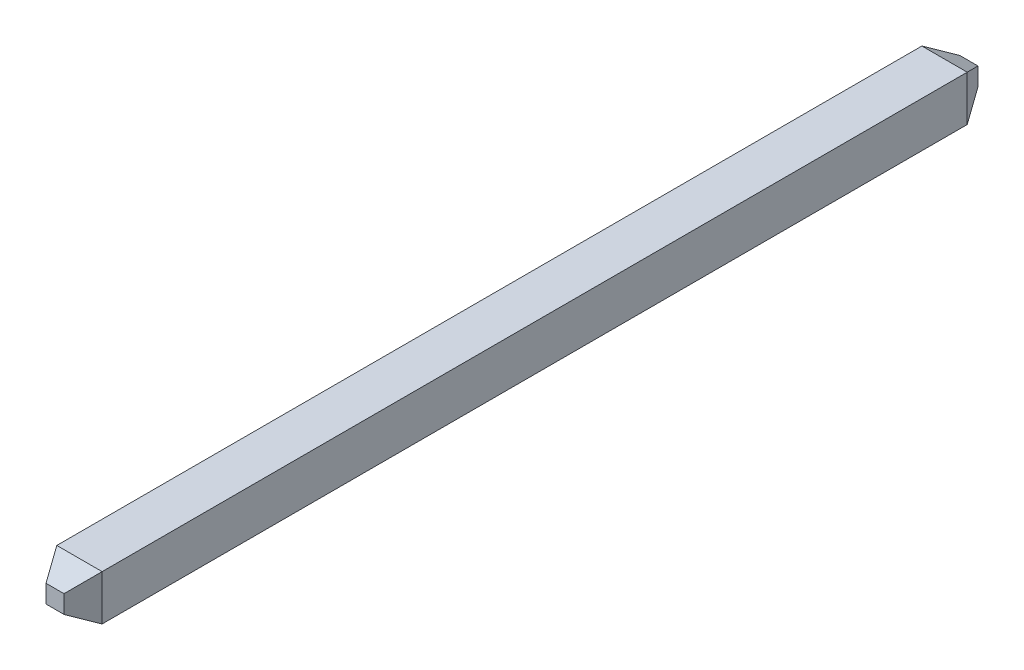
ISO-10303-21;
HEADER;
FILE_DESCRIPTION(('STEP AP214'),'2;1');
FILE_NAME('part.step','',(''),(''),'','','');
FILE_SCHEMA(('AUTOMOTIVE_DESIGN { 1 0 10303 214 1 1 1 1 }'));
ENDSEC;
DATA;
#1=APPLICATION_CONTEXT('core data for automotive mechanical design processes');
#2=APPLICATION_PROTOCOL_DEFINITION('international standard','automotive_design',2000,#1);
#3=PRODUCT_CONTEXT('',#1,'mechanical');
#4=PRODUCT('Part','Part','',(#3));
#5=PRODUCT_RELATED_PRODUCT_CATEGORY('part','',(#4));
#6=PRODUCT_DEFINITION_FORMATION('','',#4);
#7=PRODUCT_DEFINITION_CONTEXT('part definition',#1,'design');
#8=PRODUCT_DEFINITION('design','',#6,#7);
#9=PRODUCT_DEFINITION_SHAPE('','',#8);
#10=(LENGTH_UNIT() NAMED_UNIT(*) SI_UNIT(.MILLI.,.METRE.));
#11=(NAMED_UNIT(*) PLANE_ANGLE_UNIT() SI_UNIT($,.RADIAN.));
#12=(NAMED_UNIT(*) SI_UNIT($,.STERADIAN.) SOLID_ANGLE_UNIT());
#13=UNCERTAINTY_MEASURE_WITH_UNIT(LENGTH_MEASURE(1.E-05),#10,'distance_accuracy_value','');
#14=(GEOMETRIC_REPRESENTATION_CONTEXT(3) GLOBAL_UNCERTAINTY_ASSIGNED_CONTEXT((#13)) GLOBAL_UNIT_ASSIGNED_CONTEXT((#10,
#11,#12)) REPRESENTATION_CONTEXT('',''));
#15=CARTESIAN_POINT('',(0.,0.,0.));
#16=DIRECTION('',(0.,0.,1.));
#17=DIRECTION('',(1.,0.,0.));
#18=AXIS2_PLACEMENT_3D('',#15,#16,#17);
#19=CARTESIAN_POINT('',(7.74011510041924,-1.595,-3.20872569516347));
#20=DIRECTION('',(0.872569516347452,0.,-0.488489958076083));
#21=DIRECTION('',(-0.488489958076083,0.,-0.872569516347452));
#22=AXIS2_PLACEMENT_3D('',#19,#20,#21);
#23=PLANE('',#22);
#24=DIRECTION('',(0.,1.,0.));
#25=VECTOR('',#24,1.);
#26=CARTESIAN_POINT('',(7.93534185664469,-1.595,-2.86000017186176));
#27=LINE('',#26,#25);
#28=CARTESIAN_POINT('',(7.93534185663263,-1.58500002468493,-2.85999984563027));
#29=VERTEX_POINT('',#28);
#30=CARTESIAN_POINT('',(7.93534201729187,-0.954999839641339,-2.8599998849043));
#31=VERTEX_POINT('',#30);
#32=EDGE_CURVE('E118',#29,#31,#27,.T.);
#33=ORIENTED_EDGE('',*,*,#32,.F.);
#34=DIRECTION('',(0.43907261756865,-0.438284036988111,0.784297353956278));
#35=VECTOR('',#34,1.);
#36=CARTESIAN_POINT('',(7.745,-1.395,-3.2));
#37=LINE('',#36,#35);
#38=CARTESIAN_POINT('',(7.745,-1.395,-3.2));
#39=VERTEX_POINT('',#38);
#40=EDGE_CURVE('E116',#39,#29,#37,.T.);
#41=ORIENTED_EDGE('',*,*,#40,.F.);
#42=DIRECTION('',(0.,1.,0.));
#43=VECTOR('',#42,1.);
#44=CARTESIAN_POINT('',(7.745,-1.405,-3.2));
#45=LINE('',#44,#43);
#46=CARTESIAN_POINT('',(7.745,-1.145,-3.2));
#47=VERTEX_POINT('',#46);
#48=EDGE_CURVE('E79',#47,#39,#45,.F.);
#49=ORIENTED_EDGE('',*,*,#48,.F.);
#50=DIRECTION('',(-0.439072617568649,-0.43828403698811,-0.784297353956278));
#51=VECTOR('',#50,1.);
#52=CARTESIAN_POINT('',(7.93534185664468,-0.955000000000001,-2.86000017186176));
#53=LINE('',#52,#51);
#54=EDGE_CURVE('E110',#31,#47,#53,.T.);
#55=ORIENTED_EDGE('',*,*,#54,.F.);
#56=EDGE_LOOP('',(#33,#41,#49,#55));
#57=FACE_BOUND('',#56,.T.);
#58=ADVANCED_FACE('F17',(#57),#23,.T.);
#59=CARTESIAN_POINT('',(7.74036702814295,-1.595,9.50441734607014));
#60=DIRECTION('',(0.873317045523298,0.,0.487152273933376));
#61=DIRECTION('',(0.487152273933376,0.,-0.873317045523298));
#62=AXIS2_PLACEMENT_3D('',#59,#60,#61);
#63=PLANE('',#62);
#64=DIRECTION('',(-0.437799852400914,0.438586917260841,0.784839349959831));
#65=VECTOR('',#64,1.);
#66=CARTESIAN_POINT('',(7.93489789955165,-1.58500031317147,9.15568378706484));
#67=LINE('',#66,#65);
#68=CARTESIAN_POINT('',(7.93489765454993,-1.58500010892315,9.15568368845102));
#69=VERTEX_POINT('',#68);
#70=CARTESIAN_POINT('',(7.74523855088228,-1.395,9.49568417561491));
#71=VERTEX_POINT('',#70);
#72=EDGE_CURVE('E122',#69,#71,#67,.T.);
#73=ORIENTED_EDGE('',*,*,#72,.F.);
#74=DIRECTION('',(0.,1.,0.));
#75=VECTOR('',#74,1.);
#76=CARTESIAN_POINT('',(7.93489853900643,-1.595,9.15568372243698));
#77=LINE('',#76,#75);
#78=CARTESIAN_POINT('',(7.93489765280461,-0.954999822967399,9.15568371270385));
#79=VERTEX_POINT('',#78);
#80=EDGE_CURVE('E89',#79,#69,#77,.F.);
#81=ORIENTED_EDGE('',*,*,#80,.F.);
#82=DIRECTION('',(0.437799852400912,0.438586917260841,-0.784839349959832));
#83=VECTOR('',#82,1.);
#84=CARTESIAN_POINT('',(7.74523855088228,-1.145,9.49568417561491));
#85=LINE('',#84,#83);
#86=CARTESIAN_POINT('',(7.74523855088228,-1.145,9.49568417561491));
#87=VERTEX_POINT('',#86);
#88=EDGE_CURVE('E84',#87,#79,#85,.T.);
#89=ORIENTED_EDGE('',*,*,#88,.F.);
#90=DIRECTION('',(0.,1.,0.));
#91=VECTOR('',#90,1.);
#92=CARTESIAN_POINT('',(7.74523855088228,-1.135,9.49568417561491));
#93=LINE('',#92,#91);
#94=EDGE_CURVE('E20',#71,#87,#93,.T.);
#95=ORIENTED_EDGE('',*,*,#94,.F.);
#96=EDGE_LOOP('',(#73,#81,#89,#95));
#97=FACE_BOUND('',#96,.T.);
#98=ADVANCED_FACE('F86',(#97),#63,.T.);
#99=CARTESIAN_POINT('',(7.48523855088228,-1.135,9.49568417561491));
#100=DIRECTION('',(0.,0.,1.));
#101=DIRECTION('',(1.,0.,0.));
#102=AXIS2_PLACEMENT_3D('',#99,#100,#101);
#103=PLANE('',#102);
#104=DIRECTION('',(1.,0.,0.));
#105=VECTOR('',#104,1.);
#106=CARTESIAN_POINT('',(7.2948966942376,-1.145,9.49568417561491));
#107=LINE('',#106,#105);
#108=CARTESIAN_POINT('',(7.49523855088228,-1.145,9.49568417561491));
#109=VERTEX_POINT('',#108);
#110=EDGE_CURVE('E93',#109,#87,#107,.T.);
#111=ORIENTED_EDGE('',*,*,#110,.F.);
#112=DIRECTION('',(0.,1.,0.));
#113=VECTOR('',#112,1.);
#114=CARTESIAN_POINT('',(7.49523855088228,-1.595,9.49568417561491));
#115=LINE('',#114,#113);
#116=CARTESIAN_POINT('',(7.49523855088228,-1.395,9.49568417561491));
#117=VERTEX_POINT('',#116);
#118=EDGE_CURVE('E129',#117,#109,#115,.T.);
#119=ORIENTED_EDGE('',*,*,#118,.F.);
#120=DIRECTION('',(1.,0.,0.));
#121=VECTOR('',#120,1.);
#122=CARTESIAN_POINT('',(7.2948966942376,-1.395,9.49568417561491));
#123=LINE('',#122,#121);
#124=EDGE_CURVE('E98',#71,#117,#123,.F.);
#125=ORIENTED_EDGE('',*,*,#124,.F.);
#126=ORIENTED_EDGE('',*,*,#94,.T.);
#127=EDGE_LOOP('',(#111,#119,#125,#126));
#128=FACE_BOUND('',#127,.T.);
#129=ADVANCED_FACE('F95',(#128),#103,.T.);
#130=CARTESIAN_POINT('',(7.2948966942376,-1.14987821545568,9.50441360938624));
#131=DIRECTION('',(0.,0.872943377132664,0.487821545567864));
#132=DIRECTION('',(0.,-0.487821545567864,0.872943377132664));
#133=AXIS2_PLACEMENT_3D('',#130,#131,#132);
#134=PLANE('',#133);
#135=DIRECTION('',(-0.439072459537929,0.438284700441656,-0.784297071672515));
#136=VECTOR('',#135,1.);
#137=CARTESIAN_POINT('',(7.49523855088228,-1.145,9.49568417561491));
#138=LINE('',#137,#136);
#139=CARTESIAN_POINT('',(7.3048975037028,-0.954999917527424,9.15568447138296));
#140=VERTEX_POINT('',#139);
#141=EDGE_CURVE('E102',#109,#140,#138,.T.);
#142=ORIENTED_EDGE('',*,*,#141,.F.);
#143=ORIENTED_EDGE('',*,*,#110,.T.);
#144=ORIENTED_EDGE('',*,*,#88,.T.);
#145=DIRECTION('',(1.,0.,0.));
#146=VECTOR('',#145,1.);
#147=CARTESIAN_POINT('',(7.62006658937282,-0.955,9.15568497320463));
#148=LINE('',#147,#146);
#149=EDGE_CURVE('E131',#140,#79,#148,.T.);
#150=ORIENTED_EDGE('',*,*,#149,.F.);
#151=EDGE_LOOP('',(#142,#143,#144,#150));
#152=FACE_BOUND('',#151,.T.);
#153=ADVANCED_FACE('F100',(#152),#134,.T.);
#154=CARTESIAN_POINT('',(7.485,-1.405,-3.2));
#155=DIRECTION('',(0.,0.,-1.));
#156=DIRECTION('',(-1.,0.,0.));
#157=AXIS2_PLACEMENT_3D('',#154,#155,#156);
#158=PLANE('',#157);
#159=ORIENTED_EDGE('',*,*,#48,.T.);
#160=DIRECTION('',(1.,0.,0.));
#161=VECTOR('',#160,1.);
#162=CARTESIAN_POINT('',(7.29534185664468,-1.395,-3.2));
#163=LINE('',#162,#161);
#164=CARTESIAN_POINT('',(7.495,-1.395,-3.2));
#165=VERTEX_POINT('',#164);
#166=EDGE_CURVE('E113',#165,#39,#163,.T.);
#167=ORIENTED_EDGE('',*,*,#166,.F.);
#168=DIRECTION('',(0.,1.,0.));
#169=VECTOR('',#168,1.);
#170=CARTESIAN_POINT('',(7.49500000000001,-1.595,-3.2));
#171=LINE('',#170,#169);
#172=CARTESIAN_POINT('',(7.495,-1.145,-3.2));
#173=VERTEX_POINT('',#172);
#174=EDGE_CURVE('E140',#173,#165,#171,.F.);
#175=ORIENTED_EDGE('',*,*,#174,.F.);
#176=DIRECTION('',(1.,0.,0.));
#177=VECTOR('',#176,1.);
#178=CARTESIAN_POINT('',(7.29534185664468,-1.145,-3.2));
#179=LINE('',#178,#177);
#180=EDGE_CURVE('E105',#47,#173,#179,.F.);
#181=ORIENTED_EDGE('',*,*,#180,.F.);
#182=EDGE_LOOP('',(#159,#167,#175,#181));
#183=FACE_BOUND('',#182,.T.);
#184=ADVANCED_FACE('F184',(#183),#158,.T.);
#185=CARTESIAN_POINT('',(7.29534185664468,-0.950121784544321,-2.85127073809043));
#186=DIRECTION('',(0.,0.872943377132663,-0.487821545567865));
#187=DIRECTION('',(0.,0.487821545567865,0.872943377132663));
#188=AXIS2_PLACEMENT_3D('',#185,#186,#187);
#189=PLANE('',#188);
#190=DIRECTION('',(1.,0.,0.));
#191=VECTOR('',#190,1.);
#192=CARTESIAN_POINT('',(7.62006658937282,-0.955,-2.86000017186176));
#193=LINE('',#192,#191);
#194=CARTESIAN_POINT('',(7.30534144768619,-0.954999293190895,-2.8599984305592));
#195=VERTEX_POINT('',#194);
#196=EDGE_CURVE('E137',#31,#195,#193,.F.);
#197=ORIENTED_EDGE('',*,*,#196,.F.);
#198=ORIENTED_EDGE('',*,*,#54,.T.);
#199=ORIENTED_EDGE('',*,*,#180,.T.);
#200=DIRECTION('',(0.437798396819595,-0.438586429089663,-0.784840434713051));
#201=VECTOR('',#200,1.);
#202=CARTESIAN_POINT('',(7.30534066407532,-0.954999279369218,-2.8599980339447));
#203=LINE('',#202,#201);
#204=EDGE_CURVE('E145',#195,#173,#203,.T.);
#205=ORIENTED_EDGE('',*,*,#204,.F.);
#206=EDGE_LOOP('',(#197,#198,#199,#205));
#207=FACE_BOUND('',#206,.T.);
#208=ADVANCED_FACE('F182',(#207),#189,.T.);
#209=CARTESIAN_POINT('',(7.29534185664468,-1.39012178454432,-3.20872943377133));
#210=DIRECTION('',(0.,-0.872943377132663,-0.487821545567865));
#211=DIRECTION('',(0.,0.487821545567865,-0.872943377132663));
#212=AXIS2_PLACEMENT_3D('',#209,#210,#211);
#213=PLANE('',#212);
#214=ORIENTED_EDGE('',*,*,#166,.T.);
#215=ORIENTED_EDGE('',*,*,#40,.T.);
#216=DIRECTION('',(1.,0.,0.));
#217=VECTOR('',#216,1.);
#218=CARTESIAN_POINT('',(7.29494834685547,-1.585,-2.85999756200982));
#219=LINE('',#218,#217);
#220=CARTESIAN_POINT('',(7.30534198218489,-1.58500027023654,-2.85999898491791));
#221=VERTEX_POINT('',#220);
#222=EDGE_CURVE('E35',#221,#29,#219,.T.);
#223=ORIENTED_EDGE('',*,*,#222,.F.);
#224=DIRECTION('',(-0.437798396819596,-0.43858642908966,0.784840434713052));
#225=VECTOR('',#224,1.);
#226=CARTESIAN_POINT('',(7.49500000000001,-1.395,-3.2));
#227=LINE('',#226,#225);
#228=EDGE_CURVE('E143',#165,#221,#227,.T.);
#229=ORIENTED_EDGE('',*,*,#228,.F.);
#230=EDGE_LOOP('',(#214,#215,#223,#229));
#231=FACE_BOUND('',#230,.T.);
#232=ADVANCED_FACE('F185',(#231),#213,.T.);
#233=CARTESIAN_POINT('',(7.93534630826876,-1.595,-2.98065701705514));
#234=DIRECTION('',(0.999999999319383,0.,3.68949151671205E-05));
#235=DIRECTION('',(3.68949151671205E-05,0.,-0.999999999319383));
#236=AXIS2_PLACEMENT_3D('',#233,#234,#235);
#237=PLANE('',#236);
#238=DIRECTION('',(3.69481335090154E-05,0.,-0.999999999317418));
#239=VECTOR('',#238,1.);
#240=CARTESIAN_POINT('',(7.93489789955165,-0.955,9.15568372241339));
#241=LINE('',#240,#239);
#242=EDGE_CURVE('E134',#79,#31,#241,.T.);
#243=ORIENTED_EDGE('',*,*,#242,.F.);
#244=ORIENTED_EDGE('',*,*,#80,.T.);
#245=DIRECTION('',(-3.69481335090154E-05,0.,0.999999999317418));
#246=VECTOR('',#245,1.);
#247=CARTESIAN_POINT('',(7.93534185664468,-1.585,-2.86000017186176));
#248=LINE('',#247,#246);
#249=EDGE_CURVE('E149',#29,#69,#248,.T.);
#250=ORIENTED_EDGE('',*,*,#249,.F.);
#251=ORIENTED_EDGE('',*,*,#32,.T.);
#252=EDGE_LOOP('',(#243,#244,#250,#251));
#253=FACE_BOUND('',#252,.T.);
#254=ADVANCED_FACE('F187',(#253),#237,.T.);
#255=CARTESIAN_POINT('',(7.2948966942376,-1.58987821545568,9.14695491370534));
#256=DIRECTION('',(0.,-0.872943377132664,0.487821545567864));
#257=DIRECTION('',(0.,-0.487821545567864,-0.872943377132664));
#258=AXIS2_PLACEMENT_3D('',#255,#256,#257);
#259=PLANE('',#258);
#260=ORIENTED_EDGE('',*,*,#124,.T.);
#261=DIRECTION('',(0.439072459537927,0.438284700441663,0.784297071672512));
#262=VECTOR('',#261,1.);
#263=CARTESIAN_POINT('',(7.30489724886555,-1.58499980236491,9.15568533818574));
#264=LINE('',#263,#262);
#265=CARTESIAN_POINT('',(7.30489781760238,-1.5849998839243,9.15568487573227));
#266=VERTEX_POINT('',#265);
#267=EDGE_CURVE('E126',#266,#117,#264,.T.);
#268=ORIENTED_EDGE('',*,*,#267,.F.);
#269=DIRECTION('',(1.,0.,0.));
#270=VECTOR('',#269,1.);
#271=CARTESIAN_POINT('',(7.29494834685547,-1.585,9.15568372241339));
#272=LINE('',#271,#270);
#273=EDGE_CURVE('E152',#69,#266,#272,.F.);
#274=ORIENTED_EDGE('',*,*,#273,.F.);
#275=ORIENTED_EDGE('',*,*,#72,.T.);
#276=EDGE_LOOP('',(#260,#268,#274,#275));
#277=FACE_BOUND('',#276,.T.);
#278=ADVANCED_FACE('F174',(#277),#259,.T.);
#279=CARTESIAN_POINT('',(7.50012345046305,-1.595,9.50440987077839));
#280=DIRECTION('',(-0.872569516347454,0.,0.48848995807608));
#281=DIRECTION('',(0.48848995807608,0.,0.872569516347454));
#282=AXIS2_PLACEMENT_3D('',#279,#280,#281);
#283=PLANE('',#282);
#284=ORIENTED_EDGE('',*,*,#267,.T.);
#285=ORIENTED_EDGE('',*,*,#118,.T.);
#286=ORIENTED_EDGE('',*,*,#141,.T.);
#287=DIRECTION('',(0.,1.,0.));
#288=VECTOR('',#287,1.);
#289=CARTESIAN_POINT('',(7.30489853896028,-1.595,9.15568497322817));
#290=LINE('',#289,#288);
#291=EDGE_CURVE('E155',#266,#140,#290,.T.);
#292=ORIENTED_EDGE('',*,*,#291,.F.);
#293=EDGE_LOOP('',(#284,#285,#286,#292));
#294=FACE_BOUND('',#293,.T.);
#295=ADVANCED_FACE('F177',(#294),#283,.T.);
#296=CARTESIAN_POINT('',(7.62006658937282,-0.955,9.32634470275115));
#297=DIRECTION('',(0.,1.,0.));
#298=DIRECTION('',(0.,0.,1.));
#299=AXIS2_PLACEMENT_3D('',#296,#297,#298);
#300=PLANE('',#299);
#301=ORIENTED_EDGE('',*,*,#196,.T.);
#302=DIRECTION('',(-3.68949151674615E-05,0.,0.999999999319383));
#303=VECTOR('',#302,1.);
#304=CARTESIAN_POINT('',(7.30489224235438,-0.955000197635094,9.32634821671993));
#305=LINE('',#304,#303);
#306=EDGE_CURVE('E158',#140,#195,#305,.F.);
#307=ORIENTED_EDGE('',*,*,#306,.F.);
#308=ORIENTED_EDGE('',*,*,#149,.T.);
#309=ORIENTED_EDGE('',*,*,#242,.T.);
#310=EDGE_LOOP('',(#301,#307,#308,#309));
#311=FACE_BOUND('',#310,.T.);
#312=ADVANCED_FACE('F179',(#311),#300,.T.);
#313=CARTESIAN_POINT('',(7.49987152273934,-1.595,-3.20873317045523));
#314=DIRECTION('',(-0.873317045523296,0.,-0.487152273933378));
#315=DIRECTION('',(-0.487152273933378,0.,0.873317045523296));
#316=AXIS2_PLACEMENT_3D('',#313,#314,#315);
#317=PLANE('',#316);
#318=DIRECTION('',(0.,1.,0.));
#319=VECTOR('',#318,1.);
#320=CARTESIAN_POINT('',(7.30534185654839,-1.595,-2.85999756199704));
#321=LINE('',#320,#319);
#322=EDGE_CURVE('E26',#195,#221,#321,.F.);
#323=ORIENTED_EDGE('',*,*,#322,.F.);
#324=ORIENTED_EDGE('',*,*,#204,.T.);
#325=ORIENTED_EDGE('',*,*,#174,.T.);
#326=ORIENTED_EDGE('',*,*,#228,.T.);
#327=EDGE_LOOP('',(#323,#324,#325,#326));
#328=FACE_BOUND('',#327,.T.);
#329=ADVANCED_FACE('F168',(#328),#317,.T.);
#330=CARTESIAN_POINT('',(7.29494834685547,-1.585,3.17284922525592));
#331=DIRECTION('',(0.,-1.,0.));
#332=DIRECTION('',(0.,0.,-1.));
#333=AXIS2_PLACEMENT_3D('',#330,#331,#332);
#334=PLANE('',#333);
#335=ORIENTED_EDGE('',*,*,#249,.T.);
#336=ORIENTED_EDGE('',*,*,#273,.T.);
#337=DIRECTION('',(-3.68949151674615E-05,0.,0.999999999319383));
#338=VECTOR('',#337,1.);
#339=CARTESIAN_POINT('',(7.30489224235438,-1.58500072063078,9.32634821671993));
#340=LINE('',#339,#338);
#341=EDGE_CURVE('E11',#221,#266,#340,.T.);
#342=ORIENTED_EDGE('',*,*,#341,.F.);
#343=ORIENTED_EDGE('',*,*,#222,.T.);
#344=EDGE_LOOP('',(#335,#336,#342,#343));
#345=FACE_BOUND('',#344,.T.);
#346=ADVANCED_FACE('F170',(#345),#334,.T.);
#347=CARTESIAN_POINT('',(7.30489224235438,-1.595,9.32634821671993));
#348=DIRECTION('',(-0.999999999319383,0.,-3.68949151674615E-05));
#349=DIRECTION('',(-3.68949151674615E-05,0.,0.999999999319383));
#350=AXIS2_PLACEMENT_3D('',#347,#348,#349);
#351=PLANE('',#350);
#352=ORIENTED_EDGE('',*,*,#322,.T.);
#353=ORIENTED_EDGE('',*,*,#341,.T.);
#354=ORIENTED_EDGE('',*,*,#291,.T.);
#355=ORIENTED_EDGE('',*,*,#306,.T.);
#356=EDGE_LOOP('',(#352,#353,#354,#355));
#357=FACE_BOUND('',#356,.T.);
#358=ADVANCED_FACE('F164',(#357),#351,.T.);
#359=CLOSED_SHELL('',(#58,#98,#129,#153,#184,#208,#232,#254,#278,#295,#312,#329,#346,#358));
#360=MANIFOLD_SOLID_BREP('B1',#359);
#361=ADVANCED_BREP_SHAPE_REPRESENTATION('',(#18,#360),#14);
#362=SHAPE_DEFINITION_REPRESENTATION(#9,#361);
ENDSEC;
END-ISO-10303-21;
